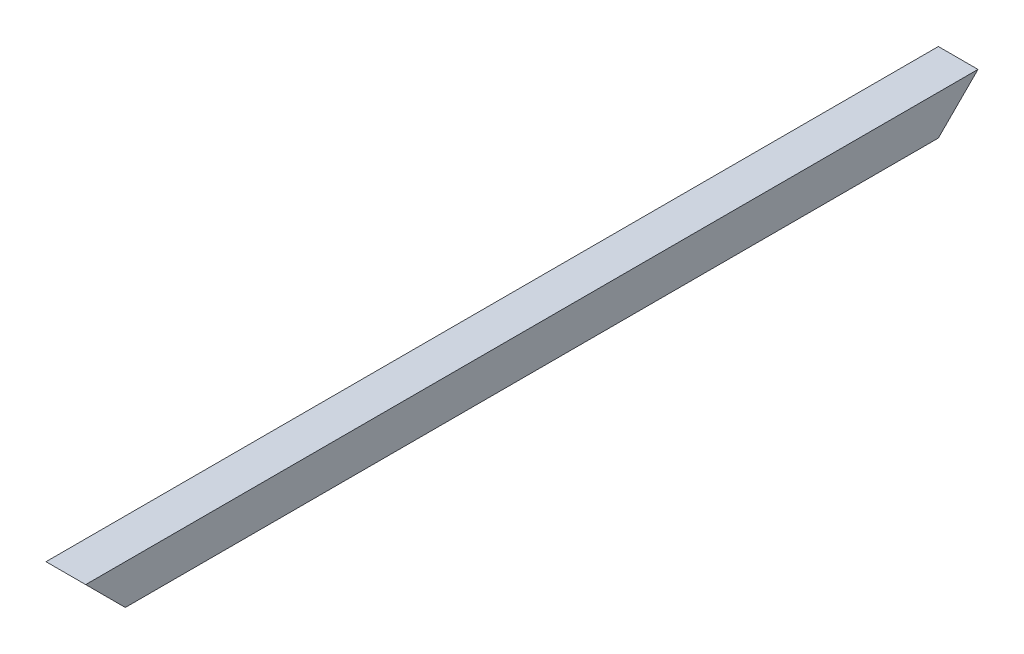
ISO-10303-21;
HEADER;
FILE_DESCRIPTION(('STEP AP214'),'2;1');
FILE_NAME('part.step','',(''),(''),'','','');
FILE_SCHEMA(('AUTOMOTIVE_DESIGN { 1 0 10303 214 1 1 1 1 }'));
ENDSEC;
DATA;
#1=APPLICATION_CONTEXT('core data for automotive mechanical design processes');
#2=APPLICATION_PROTOCOL_DEFINITION('international standard','automotive_design',2000,#1);
#3=PRODUCT_CONTEXT('',#1,'mechanical');
#4=PRODUCT('Part','Part','',(#3));
#5=PRODUCT_RELATED_PRODUCT_CATEGORY('part','',(#4));
#6=PRODUCT_DEFINITION_FORMATION('','',#4);
#7=PRODUCT_DEFINITION_CONTEXT('part definition',#1,'design');
#8=PRODUCT_DEFINITION('design','',#6,#7);
#9=PRODUCT_DEFINITION_SHAPE('','',#8);
#10=(LENGTH_UNIT() NAMED_UNIT(*) SI_UNIT(.MILLI.,.METRE.));
#11=(NAMED_UNIT(*) PLANE_ANGLE_UNIT() SI_UNIT($,.RADIAN.));
#12=(NAMED_UNIT(*) SI_UNIT($,.STERADIAN.) SOLID_ANGLE_UNIT());
#13=UNCERTAINTY_MEASURE_WITH_UNIT(LENGTH_MEASURE(1.E-05),#10,'distance_accuracy_value','');
#14=(GEOMETRIC_REPRESENTATION_CONTEXT(3) GLOBAL_UNCERTAINTY_ASSIGNED_CONTEXT((#13)) GLOBAL_UNIT_ASSIGNED_CONTEXT((#10,
#11,#12)) REPRESENTATION_CONTEXT('',''));
#15=CARTESIAN_POINT('',(0.,0.,0.));
#16=DIRECTION('',(0.,0.,1.));
#17=DIRECTION('',(1.,0.,0.));
#18=AXIS2_PLACEMENT_3D('',#15,#16,#17);
#19=CARTESIAN_POINT('',(-50.,-50.,1125.));
#20=DIRECTION('',(1.,0.,0.));
#21=DIRECTION('',(0.,0.,-1.));
#22=AXIS2_PLACEMENT_3D('',#19,#20,#21);
#23=PLANE('',#22);
#24=DIRECTION('',(0.,-0.707106781186555,0.70710678118654));
#25=VECTOR('',#24,1.);
#26=CARTESIAN_POINT('',(-50.,49.9999999999999,-1125.));
#27=LINE('',#26,#25);
#28=CARTESIAN_POINT('',(-50.,49.9999999999999,-1125.));
#29=VERTEX_POINT('',#28);
#30=CARTESIAN_POINT('',(-50.,-50.,-1025.));
#31=VERTEX_POINT('',#30);
#32=EDGE_CURVE('E98',#29,#31,#27,.T.);
#33=ORIENTED_EDGE('',*,*,#32,.T.);
#34=DIRECTION('',(0.,0.,-1.));
#35=VECTOR('',#34,1.);
#36=CARTESIAN_POINT('',(-50.,-50.,1125.));
#37=LINE('',#36,#35);
#38=CARTESIAN_POINT('',(-50.,-50.,1025.));
#39=VERTEX_POINT('',#38);
#40=EDGE_CURVE('E40',#39,#31,#37,.T.);
#41=ORIENTED_EDGE('',*,*,#40,.F.);
#42=DIRECTION('',(0.,0.707106781186539,0.707106781186556));
#43=VECTOR('',#42,1.);
#44=CARTESIAN_POINT('',(-50.,49.9999999999999,1125.));
#45=LINE('',#44,#43);
#46=CARTESIAN_POINT('',(-50.,49.9999999999999,1125.));
#47=VERTEX_POINT('',#46);
#48=EDGE_CURVE('E151',#39,#47,#45,.T.);
#49=ORIENTED_EDGE('',*,*,#48,.T.);
#50=DIRECTION('',(0.,0.,-1.));
#51=VECTOR('',#50,1.);
#52=CARTESIAN_POINT('',(-50.,49.9999999999999,1125.));
#53=LINE('',#52,#51);
#54=EDGE_CURVE('E113',#47,#29,#53,.T.);
#55=ORIENTED_EDGE('',*,*,#54,.T.);
#56=EDGE_LOOP('',(#33,#41,#49,#55));
#57=FACE_BOUND('',#56,.T.);
#58=ADVANCED_FACE('F33',(#57),#23,.F.);
#59=CARTESIAN_POINT('',(-50.,-50.,1125.));
#60=DIRECTION('',(0.,1.,0.));
#61=DIRECTION('',(0.,0.,1.));
#62=AXIS2_PLACEMENT_3D('',#59,#60,#61);
#63=PLANE('',#62);
#64=DIRECTION('',(-1.,0.,0.));
#65=VECTOR('',#64,1.);
#66=CARTESIAN_POINT('',(50.,-50.,-1025.));
#67=LINE('',#66,#65);
#68=CARTESIAN_POINT('',(50.,-50.,-1025.));
#69=VERTEX_POINT('',#68);
#70=EDGE_CURVE('E95',#69,#31,#67,.T.);
#71=ORIENTED_EDGE('',*,*,#70,.F.);
#72=DIRECTION('',(0.,0.,-1.));
#73=VECTOR('',#72,1.);
#74=CARTESIAN_POINT('',(50.,-50.,1125.));
#75=LINE('',#74,#73);
#76=CARTESIAN_POINT('',(50.,-50.,1025.));
#77=VERTEX_POINT('',#76);
#78=EDGE_CURVE('E118',#77,#69,#75,.T.);
#79=ORIENTED_EDGE('',*,*,#78,.F.);
#80=DIRECTION('',(-1.,0.,0.));
#81=VECTOR('',#80,1.);
#82=CARTESIAN_POINT('',(50.,-50.,1025.));
#83=LINE('',#82,#81);
#84=EDGE_CURVE('E117',#77,#39,#83,.T.);
#85=ORIENTED_EDGE('',*,*,#84,.T.);
#86=ORIENTED_EDGE('',*,*,#40,.T.);
#87=EDGE_LOOP('',(#71,#79,#85,#86));
#88=FACE_BOUND('',#87,.T.);
#89=ADVANCED_FACE('F116',(#88),#63,.F.);
#90=CARTESIAN_POINT('',(50.,-50.,1125.));
#91=DIRECTION('',(-1.,0.,0.));
#92=DIRECTION('',(0.,-1.,0.));
#93=AXIS2_PLACEMENT_3D('',#90,#91,#92);
#94=PLANE('',#93);
#95=DIRECTION('',(0.,-0.707106781186555,0.70710678118654));
#96=VECTOR('',#95,1.);
#97=CARTESIAN_POINT('',(50.,49.9999999999999,-1125.));
#98=LINE('',#97,#96);
#99=CARTESIAN_POINT('',(50.,49.9999999999999,-1125.));
#100=VERTEX_POINT('',#99);
#101=EDGE_CURVE('E101',#100,#69,#98,.T.);
#102=ORIENTED_EDGE('',*,*,#101,.F.);
#103=DIRECTION('',(0.,0.,-1.));
#104=VECTOR('',#103,1.);
#105=CARTESIAN_POINT('',(49.9999999999999,49.9999999999999,1125.));
#106=LINE('',#105,#104);
#107=CARTESIAN_POINT('',(49.9999999999999,49.9999999999999,1125.));
#108=VERTEX_POINT('',#107);
#109=EDGE_CURVE('E119',#108,#100,#106,.T.);
#110=ORIENTED_EDGE('',*,*,#109,.F.);
#111=DIRECTION('',(0.,0.707106781186539,0.707106781186556));
#112=VECTOR('',#111,1.);
#113=CARTESIAN_POINT('',(50.,49.9999999999999,1125.));
#114=LINE('',#113,#112);
#115=EDGE_CURVE('E149',#77,#108,#114,.T.);
#116=ORIENTED_EDGE('',*,*,#115,.F.);
#117=ORIENTED_EDGE('',*,*,#78,.T.);
#118=EDGE_LOOP('',(#102,#110,#116,#117));
#119=FACE_BOUND('',#118,.T.);
#120=ADVANCED_FACE('F186',(#119),#94,.F.);
#121=CARTESIAN_POINT('',(-45.,-45.,1125.));
#122=DIRECTION('',(1.,0.,0.));
#123=DIRECTION('',(0.,0.,-1.));
#124=AXIS2_PLACEMENT_3D('',#121,#122,#123);
#125=PLANE('',#124);
#126=DIRECTION('',(0.,0.,-1.));
#127=VECTOR('',#126,1.);
#128=CARTESIAN_POINT('',(-45.,-45.,1125.));
#129=LINE('',#128,#127);
#130=CARTESIAN_POINT('',(-45.,-45.,1030.));
#131=VERTEX_POINT('',#130);
#132=CARTESIAN_POINT('',(-45.,-45.,-1030.));
#133=VERTEX_POINT('',#132);
#134=EDGE_CURVE('E128',#131,#133,#129,.T.);
#135=ORIENTED_EDGE('',*,*,#134,.T.);
#136=DIRECTION('',(0.,0.707106781186555,-0.70710678118654));
#137=VECTOR('',#136,1.);
#138=CARTESIAN_POINT('',(-45.,-1122.5,47.4999999999761));
#139=LINE('',#138,#137);
#140=CARTESIAN_POINT('',(-45.,44.9999999999999,-1120.));
#141=VERTEX_POINT('',#140);
#142=EDGE_CURVE('E153',#133,#141,#139,.T.);
#143=ORIENTED_EDGE('',*,*,#142,.T.);
#144=DIRECTION('',(0.,0.,-1.));
#145=VECTOR('',#144,1.);
#146=CARTESIAN_POINT('',(-45.,44.9999999999999,1125.));
#147=LINE('',#146,#145);
#148=CARTESIAN_POINT('',(-45.,44.9999999999999,1120.));
#149=VERTEX_POINT('',#148);
#150=EDGE_CURVE('E138',#149,#141,#147,.T.);
#151=ORIENTED_EDGE('',*,*,#150,.F.);
#152=DIRECTION('',(0.,-0.707106781186539,-0.707106781186556));
#153=VECTOR('',#152,1.);
#154=CARTESIAN_POINT('',(-45.,2.50000000000105,1077.5));
#155=LINE('',#154,#153);
#156=EDGE_CURVE('E55',#149,#131,#155,.T.);
#157=ORIENTED_EDGE('',*,*,#156,.T.);
#158=EDGE_LOOP('',(#135,#143,#151,#157));
#159=FACE_BOUND('',#158,.T.);
#160=ADVANCED_FACE('F174',(#159),#125,.T.);
#161=CARTESIAN_POINT('',(-45.,-45.,1125.));
#162=DIRECTION('',(0.,1.,0.));
#163=DIRECTION('',(0.,0.,1.));
#164=AXIS2_PLACEMENT_3D('',#161,#162,#163);
#165=PLANE('',#164);
#166=DIRECTION('',(0.,0.,-1.));
#167=VECTOR('',#166,1.);
#168=CARTESIAN_POINT('',(45.,-45.,1125.));
#169=LINE('',#168,#167);
#170=CARTESIAN_POINT('',(45.,-45.,1030.));
#171=VERTEX_POINT('',#170);
#172=CARTESIAN_POINT('',(45.,-44.9999999999999,-1030.));
#173=VERTEX_POINT('',#172);
#174=EDGE_CURVE('E132',#171,#173,#169,.T.);
#175=ORIENTED_EDGE('',*,*,#174,.T.);
#176=DIRECTION('',(-1.,0.,0.));
#177=VECTOR('',#176,1.);
#178=CARTESIAN_POINT('',(-45.,-45.,-1030.));
#179=LINE('',#178,#177);
#180=EDGE_CURVE('E156',#173,#133,#179,.T.);
#181=ORIENTED_EDGE('',*,*,#180,.T.);
#182=ORIENTED_EDGE('',*,*,#134,.F.);
#183=DIRECTION('',(1.,0.,0.));
#184=VECTOR('',#183,1.);
#185=CARTESIAN_POINT('',(-45.,-45.,1030.));
#186=LINE('',#185,#184);
#187=EDGE_CURVE('E142',#131,#171,#186,.T.);
#188=ORIENTED_EDGE('',*,*,#187,.T.);
#189=EDGE_LOOP('',(#175,#181,#182,#188));
#190=FACE_BOUND('',#189,.T.);
#191=ADVANCED_FACE('F172',(#190),#165,.T.);
#192=CARTESIAN_POINT('',(45.,-45.,1125.));
#193=DIRECTION('',(-1.,0.,0.));
#194=DIRECTION('',(0.,-1.,0.));
#195=AXIS2_PLACEMENT_3D('',#192,#193,#194);
#196=PLANE('',#195);
#197=DIRECTION('',(0.,0.,-1.));
#198=VECTOR('',#197,1.);
#199=CARTESIAN_POINT('',(45.,44.9999999999999,1125.));
#200=LINE('',#199,#198);
#201=CARTESIAN_POINT('',(45.,44.9999999999999,1120.));
#202=VERTEX_POINT('',#201);
#203=CARTESIAN_POINT('',(45.,44.9999999999999,-1120.));
#204=VERTEX_POINT('',#203);
#205=EDGE_CURVE('E135',#202,#204,#200,.T.);
#206=ORIENTED_EDGE('',*,*,#205,.T.);
#207=DIRECTION('',(0.,-0.707106781186555,0.70710678118654));
#208=VECTOR('',#207,1.);
#209=CARTESIAN_POINT('',(45.0000000000007,-1122.5,47.4999999999761));
#210=LINE('',#209,#208);
#211=EDGE_CURVE('E47',#204,#173,#210,.T.);
#212=ORIENTED_EDGE('',*,*,#211,.T.);
#213=ORIENTED_EDGE('',*,*,#174,.F.);
#214=DIRECTION('',(0.,0.707106781186539,0.707106781186556));
#215=VECTOR('',#214,1.);
#216=CARTESIAN_POINT('',(45.,2.50000000000105,1077.5));
#217=LINE('',#216,#215);
#218=EDGE_CURVE('E145',#171,#202,#217,.T.);
#219=ORIENTED_EDGE('',*,*,#218,.T.);
#220=EDGE_LOOP('',(#206,#212,#213,#219));
#221=FACE_BOUND('',#220,.T.);
#222=ADVANCED_FACE('F166',(#221),#196,.T.);
#223=CARTESIAN_POINT('',(-45.,44.9999999999999,1125.));
#224=DIRECTION('',(0.,-1.,0.));
#225=DIRECTION('',(0.,0.,-1.));
#226=AXIS2_PLACEMENT_3D('',#223,#224,#225);
#227=PLANE('',#226);
#228=ORIENTED_EDGE('',*,*,#150,.T.);
#229=DIRECTION('',(1.,0.,0.));
#230=VECTOR('',#229,1.);
#231=CARTESIAN_POINT('',(-45.,44.9999999999999,-1120.));
#232=LINE('',#231,#230);
#233=EDGE_CURVE('E106',#141,#204,#232,.T.);
#234=ORIENTED_EDGE('',*,*,#233,.T.);
#235=ORIENTED_EDGE('',*,*,#205,.F.);
#236=DIRECTION('',(-1.,0.,0.));
#237=VECTOR('',#236,1.);
#238=CARTESIAN_POINT('',(-45.,44.9999999999999,1120.));
#239=LINE('',#238,#237);
#240=EDGE_CURVE('E11',#202,#149,#239,.T.);
#241=ORIENTED_EDGE('',*,*,#240,.T.);
#242=EDGE_LOOP('',(#228,#234,#235,#241));
#243=FACE_BOUND('',#242,.T.);
#244=ADVANCED_FACE('F163',(#243),#227,.T.);
#245=CARTESIAN_POINT('',(-50.,49.9999999999999,1125.));
#246=DIRECTION('',(0.,-1.,0.));
#247=DIRECTION('',(0.,0.,-1.));
#248=AXIS2_PLACEMENT_3D('',#245,#246,#247);
#249=PLANE('',#248);
#250=DIRECTION('',(-1.,0.,0.));
#251=VECTOR('',#250,1.);
#252=CARTESIAN_POINT('',(-50.,49.9999999999999,-1125.));
#253=LINE('',#252,#251);
#254=EDGE_CURVE('E126',#100,#29,#253,.T.);
#255=ORIENTED_EDGE('',*,*,#254,.T.);
#256=ORIENTED_EDGE('',*,*,#54,.F.);
#257=DIRECTION('',(-1.,0.,0.));
#258=VECTOR('',#257,1.);
#259=CARTESIAN_POINT('',(-50.,49.9999999999999,1125.));
#260=LINE('',#259,#258);
#261=EDGE_CURVE('E125',#108,#47,#260,.T.);
#262=ORIENTED_EDGE('',*,*,#261,.F.);
#263=ORIENTED_EDGE('',*,*,#109,.T.);
#264=EDGE_LOOP('',(#255,#256,#262,#263));
#265=FACE_BOUND('',#264,.T.);
#266=ADVANCED_FACE('F180',(#265),#249,.F.);
#267=CARTESIAN_POINT('',(50.,49.9999999999999,1125.));
#268=DIRECTION('',(0.,-0.707106781186556,0.707106781186539));
#269=DIRECTION('',(0.,-0.707106781186539,-0.707106781186556));
#270=AXIS2_PLACEMENT_3D('',#267,#268,#269);
#271=PLANE('',#270);
#272=ORIENTED_EDGE('',*,*,#240,.F.);
#273=ORIENTED_EDGE('',*,*,#218,.F.);
#274=ORIENTED_EDGE('',*,*,#187,.F.);
#275=ORIENTED_EDGE('',*,*,#156,.F.);
#276=EDGE_LOOP('',(#272,#273,#274,#275));
#277=FACE_BOUND('',#276,.T.);
#278=ORIENTED_EDGE('',*,*,#84,.F.);
#279=ORIENTED_EDGE('',*,*,#115,.T.);
#280=ORIENTED_EDGE('',*,*,#261,.T.);
#281=ORIENTED_EDGE('',*,*,#48,.F.);
#282=EDGE_LOOP('',(#278,#279,#280,#281));
#283=FACE_BOUND('',#282,.T.);
#284=ADVANCED_FACE('F168',(#277,#283),#271,.T.);
#285=CARTESIAN_POINT('',(50.,49.9999999999999,-1125.));
#286=DIRECTION('',(0.,-0.70710678118654,-0.707106781186555));
#287=DIRECTION('',(0.,0.707106781186555,-0.70710678118654));
#288=AXIS2_PLACEMENT_3D('',#285,#286,#287);
#289=PLANE('',#288);
#290=ORIENTED_EDGE('',*,*,#180,.F.);
#291=ORIENTED_EDGE('',*,*,#211,.F.);
#292=ORIENTED_EDGE('',*,*,#233,.F.);
#293=ORIENTED_EDGE('',*,*,#142,.F.);
#294=EDGE_LOOP('',(#290,#291,#292,#293));
#295=FACE_BOUND('',#294,.T.);
#296=ORIENTED_EDGE('',*,*,#254,.F.);
#297=ORIENTED_EDGE('',*,*,#101,.T.);
#298=ORIENTED_EDGE('',*,*,#70,.T.);
#299=ORIENTED_EDGE('',*,*,#32,.F.);
#300=EDGE_LOOP('',(#296,#297,#298,#299));
#301=FACE_BOUND('',#300,.T.);
#302=ADVANCED_FACE('F97',(#295,#301),#289,.T.);
#303=CLOSED_SHELL('',(#58,#89,#120,#160,#191,#222,#244,#266,#284,#302));
#304=MANIFOLD_SOLID_BREP('B2',#303);
#305=ADVANCED_BREP_SHAPE_REPRESENTATION('',(#18,#304),#14);
#306=SHAPE_DEFINITION_REPRESENTATION(#9,#305);
ENDSEC;
END-ISO-10303-21;
